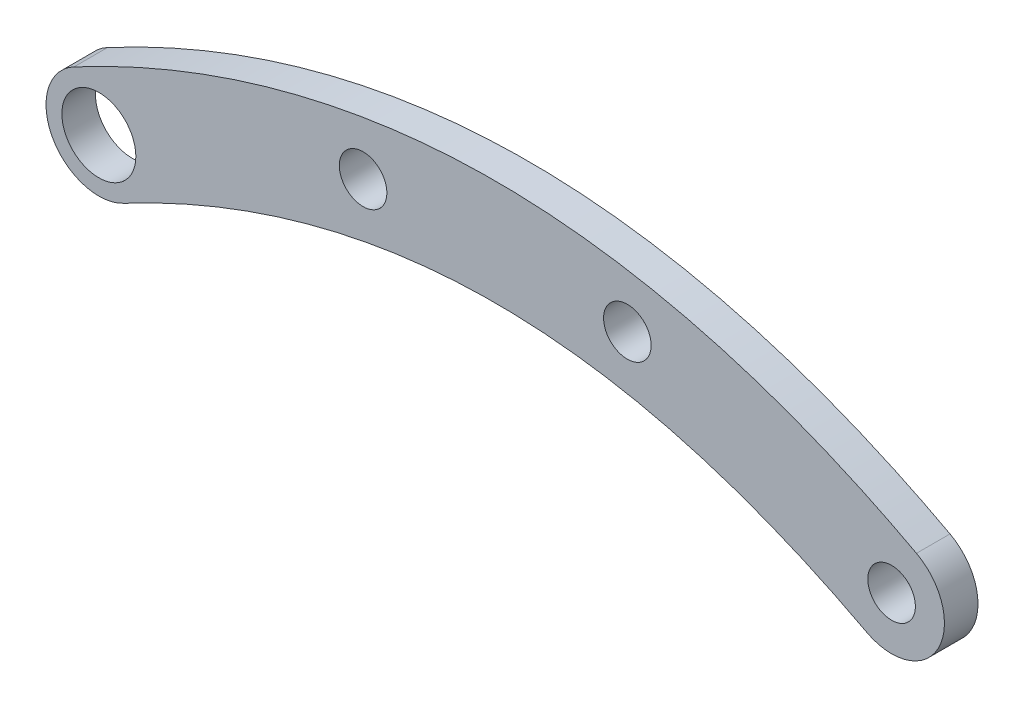
ISO-10303-21;
HEADER;
FILE_DESCRIPTION(('STEP AP214'),'2;1');
FILE_NAME('part.step','',(''),(''),'','','');
FILE_SCHEMA(('AUTOMOTIVE_DESIGN { 1 0 10303 214 1 1 1 1 }'));
ENDSEC;
DATA;
#1=APPLICATION_CONTEXT('core data for automotive mechanical design processes');
#2=APPLICATION_PROTOCOL_DEFINITION('international standard','automotive_design',2000,#1);
#3=PRODUCT_CONTEXT('',#1,'mechanical');
#4=PRODUCT('Part','Part','',(#3));
#5=PRODUCT_RELATED_PRODUCT_CATEGORY('part','',(#4));
#6=PRODUCT_DEFINITION_FORMATION('','',#4);
#7=PRODUCT_DEFINITION_CONTEXT('part definition',#1,'design');
#8=PRODUCT_DEFINITION('design','',#6,#7);
#9=PRODUCT_DEFINITION_SHAPE('','',#8);
#10=(LENGTH_UNIT() NAMED_UNIT(*) SI_UNIT(.MILLI.,.METRE.));
#11=(NAMED_UNIT(*) PLANE_ANGLE_UNIT() SI_UNIT($,.RADIAN.));
#12=(NAMED_UNIT(*) SI_UNIT($,.STERADIAN.) SOLID_ANGLE_UNIT());
#13=UNCERTAINTY_MEASURE_WITH_UNIT(LENGTH_MEASURE(1.E-05),#10,'distance_accuracy_value','');
#14=(GEOMETRIC_REPRESENTATION_CONTEXT(3) GLOBAL_UNCERTAINTY_ASSIGNED_CONTEXT((#13)) GLOBAL_UNIT_ASSIGNED_CONTEXT((#10,
#11,#12)) REPRESENTATION_CONTEXT('',''));
#15=CARTESIAN_POINT('',(0.,0.,0.));
#16=DIRECTION('',(0.,0.,1.));
#17=DIRECTION('',(1.,0.,0.));
#18=AXIS2_PLACEMENT_3D('',#15,#16,#17);
#19=CARTESIAN_POINT('',(-39.8529411764706,-5.58823529411765,1.5875));
#20=CARTESIAN_POINT('',(-25.0878353747758,2.31376151523475,1.5875));
#21=CARTESIAN_POINT('',(0.,5.67155962119131,1.5875));
#22=CARTESIAN_POINT('',(25.0878353747758,2.31376151523475,1.5875));
#23=CARTESIAN_POINT('',(39.8529411764706,-5.58823529411765,1.5875));
#24=B_SPLINE_CURVE_WITH_KNOTS('',2,(#19,#20,#21,#22,#23),.UNSPECIFIED.,.F.,.F.,(3,1,1,3),(0.,
0.375,0.625,1.),.UNSPECIFIED.);
#25=DIRECTION('',(0.,0.,-1.));
#26=VECTOR('',#25,1.);
#27=SURFACE_OF_LINEAR_EXTRUSION('',#24,#26);
#28=CARTESIAN_POINT('',(-39.8529411764706,-5.58823529411765,-1.5875));
#29=CARTESIAN_POINT('',(-25.0878353747758,2.31376151523475,-1.5875));
#30=CARTESIAN_POINT('',(0.,5.67155962119131,-1.5875));
#31=CARTESIAN_POINT('',(25.0878353747758,2.31376151523475,-1.5875));
#32=CARTESIAN_POINT('',(39.8529411764706,-5.58823529411765,-1.5875));
#33=B_SPLINE_CURVE_WITH_KNOTS('',2,(#28,#29,#30,#31,#32),.UNSPECIFIED.,.F.,.F.,(3,1,1,3),(0.,
0.375,0.625,1.),.UNSPECIFIED.);
#34=CARTESIAN_POINT('',(-39.8529411764706,-5.58823529411764,-1.5875));
#35=VERTEX_POINT('',#34);
#36=CARTESIAN_POINT('',(39.8529411764706,-5.58823529411765,-1.5875));
#37=VERTEX_POINT('',#36);
#38=EDGE_CURVE('E128',#35,#37,#33,.T.);
#39=ORIENTED_EDGE('',*,*,#38,.F.);
#40=DIRECTION('',(0.,0.,-1.));
#41=VECTOR('',#40,1.);
#42=CARTESIAN_POINT('',(-39.8529411764706,-5.58823529411764,1.5875));
#43=LINE('',#42,#41);
#44=CARTESIAN_POINT('',(-39.8529411764706,-5.58823529411764,1.5875));
#45=VERTEX_POINT('',#44);
#46=EDGE_CURVE('E11',#45,#35,#43,.T.);
#47=ORIENTED_EDGE('',*,*,#46,.F.);
#48=CARTESIAN_POINT('',(39.8529411764706,-5.58823529411765,1.5875));
#49=VERTEX_POINT('',#48);
#50=EDGE_CURVE('E101',#45,#49,#24,.T.);
#51=ORIENTED_EDGE('',*,*,#50,.T.);
#52=DIRECTION('',(0.,0.,-1.));
#53=VECTOR('',#52,1.);
#54=CARTESIAN_POINT('',(39.8529411764706,-5.58823529411765,1.5875));
#55=LINE('',#54,#53);
#56=EDGE_CURVE('E82',#49,#37,#55,.T.);
#57=ORIENTED_EDGE('',*,*,#56,.T.);
#58=EDGE_LOOP('',(#39,#47,#51,#57));
#59=FACE_BOUND('',#58,.T.);
#60=ADVANCED_FACE('F43',(#59),#27,.T.);
#61=CARTESIAN_POINT('',(-37.5,-10.,1.5875));
#62=DIRECTION('',(0.,0.,-1.));
#63=DIRECTION('',(-1.,0.,0.));
#64=AXIS2_PLACEMENT_3D('',#61,#62,#63);
#65=CYLINDRICAL_SURFACE('',#64,5.);
#66=CARTESIAN_POINT('',(-37.5,-10.,-1.5875));
#67=DIRECTION('',(0.,0.,1.));
#68=DIRECTION('',(1.,0.,0.));
#69=AXIS2_PLACEMENT_3D('',#66,#67,#68);
#70=CIRCLE('',#69,5.);
#71=CARTESIAN_POINT('',(-35.1470588235294,-14.4117647058824,-1.5875));
#72=VERTEX_POINT('',#71);
#73=EDGE_CURVE('E95',#72,#35,#70,.F.);
#74=ORIENTED_EDGE('',*,*,#73,.F.);
#75=DIRECTION('',(0.,0.,-1.));
#76=VECTOR('',#75,1.);
#77=CARTESIAN_POINT('',(-35.1470588235294,-14.4117647058824,1.5875));
#78=LINE('',#77,#76);
#79=CARTESIAN_POINT('',(-35.1470588235294,-14.4117647058824,1.5875));
#80=VERTEX_POINT('',#79);
#81=EDGE_CURVE('E52',#80,#72,#78,.T.);
#82=ORIENTED_EDGE('',*,*,#81,.F.);
#83=CARTESIAN_POINT('',(-37.5,-10.,1.5875));
#84=DIRECTION('',(0.,0.,1.));
#85=DIRECTION('',(1.,0.,0.));
#86=AXIS2_PLACEMENT_3D('',#83,#84,#85);
#87=CIRCLE('',#86,5.);
#88=EDGE_CURVE('E93',#80,#45,#87,.F.);
#89=ORIENTED_EDGE('',*,*,#88,.T.);
#90=ORIENTED_EDGE('',*,*,#46,.T.);
#91=EDGE_LOOP('',(#74,#82,#89,#90));
#92=FACE_BOUND('',#91,.T.);
#93=ADVANCED_FACE('F91',(#92),#65,.T.);
#94=CARTESIAN_POINT('',(-35.1470588235294,-14.4117647058824,1.5875));
#95=CARTESIAN_POINT('',(-21.7871646252242,-7.31376151523475,1.5875));
#96=CARTESIAN_POINT('',(0.,-4.42155962119131,1.5875));
#97=CARTESIAN_POINT('',(21.7871646252242,-7.31376151523475,1.5875));
#98=CARTESIAN_POINT('',(35.1470588235294,-14.4117647058824,1.5875));
#99=B_SPLINE_CURVE_WITH_KNOTS('',2,(#94,#95,#96,#97,#98),.UNSPECIFIED.,.F.,.F.,(3,1,1,3),(0.,
0.375,0.625,1.),.UNSPECIFIED.);
#100=DIRECTION('',(0.,0.,-1.));
#101=VECTOR('',#100,1.);
#102=SURFACE_OF_LINEAR_EXTRUSION('',#99,#101);
#103=CARTESIAN_POINT('',(-35.1470588235294,-14.4117647058824,-1.5875));
#104=CARTESIAN_POINT('',(-21.7871646252242,-7.31376151523475,-1.5875));
#105=CARTESIAN_POINT('',(0.,-4.42155962119131,-1.5875));
#106=CARTESIAN_POINT('',(21.7871646252242,-7.31376151523475,-1.5875));
#107=CARTESIAN_POINT('',(35.1470588235294,-14.4117647058824,-1.5875));
#108=B_SPLINE_CURVE_WITH_KNOTS('',2,(#103,#104,#105,#106,#107),.UNSPECIFIED.,.F.,.F.,(3,1,1,3),
(0.,0.375,0.625,1.),.UNSPECIFIED.);
#109=CARTESIAN_POINT('',(35.1470588235294,-14.4117647058824,-1.5875));
#110=VERTEX_POINT('',#109);
#111=EDGE_CURVE('E75',#72,#110,#108,.T.);
#112=ORIENTED_EDGE('',*,*,#111,.T.);
#113=DIRECTION('',(0.,0.,-1.));
#114=VECTOR('',#113,1.);
#115=CARTESIAN_POINT('',(35.1470588235294,-14.4117647058824,1.5875));
#116=LINE('',#115,#114);
#117=CARTESIAN_POINT('',(35.1470588235294,-14.4117647058824,1.5875));
#118=VERTEX_POINT('',#117);
#119=EDGE_CURVE('E96',#118,#110,#116,.T.);
#120=ORIENTED_EDGE('',*,*,#119,.F.);
#121=EDGE_CURVE('E97',#80,#118,#99,.T.);
#122=ORIENTED_EDGE('',*,*,#121,.F.);
#123=ORIENTED_EDGE('',*,*,#81,.T.);
#124=EDGE_LOOP('',(#112,#120,#122,#123));
#125=FACE_BOUND('',#124,.T.);
#126=ADVANCED_FACE('F98',(#125),#102,.F.);
#127=CARTESIAN_POINT('',(37.5,-10.,1.5875));
#128=DIRECTION('',(0.,0.,-1.));
#129=DIRECTION('',(-1.,0.,0.));
#130=AXIS2_PLACEMENT_3D('',#127,#128,#129);
#131=CYLINDRICAL_SURFACE('',#130,5.);
#132=CARTESIAN_POINT('',(37.5,-10.,-1.5875));
#133=DIRECTION('',(0.,0.,1.));
#134=DIRECTION('',(1.,0.,0.));
#135=AXIS2_PLACEMENT_3D('',#132,#133,#134);
#136=CIRCLE('',#135,5.);
#137=EDGE_CURVE('E103',#110,#37,#136,.T.);
#138=ORIENTED_EDGE('',*,*,#137,.T.);
#139=ORIENTED_EDGE('',*,*,#56,.F.);
#140=CARTESIAN_POINT('',(37.5,-10.,1.5875));
#141=DIRECTION('',(0.,0.,1.));
#142=DIRECTION('',(1.,0.,0.));
#143=AXIS2_PLACEMENT_3D('',#140,#141,#142);
#144=CIRCLE('',#143,5.);
#145=EDGE_CURVE('E60',#118,#49,#144,.T.);
#146=ORIENTED_EDGE('',*,*,#145,.F.);
#147=ORIENTED_EDGE('',*,*,#119,.T.);
#148=EDGE_LOOP('',(#138,#139,#146,#147));
#149=FACE_BOUND('',#148,.T.);
#150=ADVANCED_FACE('F119',(#149),#131,.T.);
#151=CARTESIAN_POINT('',(0.,0.,1.5875));
#152=DIRECTION('',(0.,0.,1.));
#153=DIRECTION('',(1.,0.,0.));
#154=AXIS2_PLACEMENT_3D('',#151,#152,#153);
#155=PLANE('',#154);
#156=CARTESIAN_POINT('',(-37.5,-10.,1.5875));
#157=DIRECTION('',(0.,0.,1.));
#158=DIRECTION('',(1.,0.,0.));
#159=AXIS2_PLACEMENT_3D('',#156,#157,#158);
#160=CIRCLE('',#159,3.5);
#161=CARTESIAN_POINT('',(-34.,-10.,1.5875));
#162=VERTEX_POINT('',#161);
#163=EDGE_CURVE('E181',#162,#162,#160,.T.);
#164=ORIENTED_EDGE('',*,*,#163,.F.);
#165=EDGE_LOOP('',(#164));
#166=FACE_BOUND('',#165,.T.);
#167=CARTESIAN_POINT('',(37.5,-10.,1.5875));
#168=DIRECTION('',(0.,0.,1.));
#169=DIRECTION('',(1.,0.,0.));
#170=AXIS2_PLACEMENT_3D('',#167,#168,#169);
#171=CIRCLE('',#170,2.24999999999999);
#172=CARTESIAN_POINT('',(39.75,-10.,1.5875));
#173=VERTEX_POINT('',#172);
#174=EDGE_CURVE('E183',#173,#173,#171,.T.);
#175=ORIENTED_EDGE('',*,*,#174,.F.);
#176=EDGE_LOOP('',(#175));
#177=FACE_BOUND('',#176,.T.);
#178=CARTESIAN_POINT('',(-12.5,-1.11111111111111,1.5875));
#179=DIRECTION('',(0.,0.,1.));
#180=DIRECTION('',(1.,0.,0.));
#181=AXIS2_PLACEMENT_3D('',#178,#179,#180);
#182=CIRCLE('',#181,2.24999999999999);
#183=CARTESIAN_POINT('',(-10.25,-1.11111111111111,1.5875));
#184=VERTEX_POINT('',#183);
#185=EDGE_CURVE('E191',#184,#184,#182,.T.);
#186=ORIENTED_EDGE('',*,*,#185,.F.);
#187=EDGE_LOOP('',(#186));
#188=FACE_BOUND('',#187,.T.);
#189=CARTESIAN_POINT('',(12.5,-1.11111111111111,1.5875));
#190=DIRECTION('',(0.,0.,1.));
#191=DIRECTION('',(1.,0.,0.));
#192=AXIS2_PLACEMENT_3D('',#189,#190,#191);
#193=CIRCLE('',#192,2.24999999999999);
#194=CARTESIAN_POINT('',(14.75,-1.11111111111111,1.5875));
#195=VERTEX_POINT('',#194);
#196=EDGE_CURVE('E197',#195,#195,#193,.T.);
#197=ORIENTED_EDGE('',*,*,#196,.F.);
#198=EDGE_LOOP('',(#197));
#199=FACE_BOUND('',#198,.T.);
#200=ORIENTED_EDGE('',*,*,#50,.F.);
#201=ORIENTED_EDGE('',*,*,#88,.F.);
#202=ORIENTED_EDGE('',*,*,#121,.T.);
#203=ORIENTED_EDGE('',*,*,#145,.T.);
#204=EDGE_LOOP('',(#200,#201,#202,#203));
#205=FACE_BOUND('',#204,.T.);
#206=ADVANCED_FACE('F100',(#166,#177,#188,#199,#205),#155,.T.);
#207=CARTESIAN_POINT('',(0.,0.,-1.5875));
#208=DIRECTION('',(0.,0.,1.));
#209=DIRECTION('',(1.,0.,0.));
#210=AXIS2_PLACEMENT_3D('',#207,#208,#209);
#211=PLANE('',#210);
#212=CARTESIAN_POINT('',(-37.5,-10.,-1.5875));
#213=DIRECTION('',(0.,0.,1.));
#214=DIRECTION('',(1.,0.,0.));
#215=AXIS2_PLACEMENT_3D('',#212,#213,#214);
#216=CIRCLE('',#215,3.5);
#217=CARTESIAN_POINT('',(-34.,-10.,-1.5875));
#218=VERTEX_POINT('',#217);
#219=EDGE_CURVE('E179',#218,#218,#216,.T.);
#220=ORIENTED_EDGE('',*,*,#219,.T.);
#221=EDGE_LOOP('',(#220));
#222=FACE_BOUND('',#221,.T.);
#223=CARTESIAN_POINT('',(37.5,-10.,-1.5875));
#224=DIRECTION('',(0.,0.,1.));
#225=DIRECTION('',(1.,0.,0.));
#226=AXIS2_PLACEMENT_3D('',#223,#224,#225);
#227=CIRCLE('',#226,2.25);
#228=CARTESIAN_POINT('',(39.75,-10.,-1.5875));
#229=VERTEX_POINT('',#228);
#230=EDGE_CURVE('E188',#229,#229,#227,.T.);
#231=ORIENTED_EDGE('',*,*,#230,.T.);
#232=EDGE_LOOP('',(#231));
#233=FACE_BOUND('',#232,.T.);
#234=CARTESIAN_POINT('',(-12.5,-1.11111111111111,-1.5875));
#235=DIRECTION('',(0.,0.,1.));
#236=DIRECTION('',(1.,0.,0.));
#237=AXIS2_PLACEMENT_3D('',#234,#235,#236);
#238=CIRCLE('',#237,2.25);
#239=CARTESIAN_POINT('',(-10.25,-1.11111111111111,-1.5875));
#240=VERTEX_POINT('',#239);
#241=EDGE_CURVE('E194',#240,#240,#238,.T.);
#242=ORIENTED_EDGE('',*,*,#241,.T.);
#243=EDGE_LOOP('',(#242));
#244=FACE_BOUND('',#243,.T.);
#245=CARTESIAN_POINT('',(12.5,-1.11111111111111,-1.5875));
#246=DIRECTION('',(0.,0.,1.));
#247=DIRECTION('',(1.,0.,0.));
#248=AXIS2_PLACEMENT_3D('',#245,#246,#247);
#249=CIRCLE('',#248,2.25);
#250=CARTESIAN_POINT('',(14.75,-1.11111111111111,-1.5875));
#251=VERTEX_POINT('',#250);
#252=EDGE_CURVE('E131',#251,#251,#249,.T.);
#253=ORIENTED_EDGE('',*,*,#252,.T.);
#254=EDGE_LOOP('',(#253));
#255=FACE_BOUND('',#254,.T.);
#256=ORIENTED_EDGE('',*,*,#38,.T.);
#257=ORIENTED_EDGE('',*,*,#137,.F.);
#258=ORIENTED_EDGE('',*,*,#111,.F.);
#259=ORIENTED_EDGE('',*,*,#73,.T.);
#260=EDGE_LOOP('',(#256,#257,#258,#259));
#261=FACE_BOUND('',#260,.T.);
#262=ADVANCED_FACE('F132',(#222,#233,#244,#255,#261),#211,.F.);
#263=CARTESIAN_POINT('',(12.5,-1.11111111111111,1.5875));
#264=DIRECTION('',(0.,0.,1.));
#265=DIRECTION('',(1.,0.,0.));
#266=AXIS2_PLACEMENT_3D('',#263,#264,#265);
#267=CYLINDRICAL_SURFACE('',#266,2.24999999999999);
#268=ORIENTED_EDGE('',*,*,#252,.F.);
#269=EDGE_LOOP('',(#268));
#270=FACE_BOUND('',#269,.T.);
#271=ORIENTED_EDGE('',*,*,#196,.T.);
#272=EDGE_LOOP('',(#271));
#273=FACE_BOUND('',#272,.T.);
#274=ADVANCED_FACE('F156',(#270,#273),#267,.F.);
#275=CARTESIAN_POINT('',(-12.5,-1.11111111111111,1.5875));
#276=DIRECTION('',(0.,0.,1.));
#277=DIRECTION('',(1.,0.,0.));
#278=AXIS2_PLACEMENT_3D('',#275,#276,#277);
#279=CYLINDRICAL_SURFACE('',#278,2.24999999999999);
#280=ORIENTED_EDGE('',*,*,#241,.F.);
#281=EDGE_LOOP('',(#280));
#282=FACE_BOUND('',#281,.T.);
#283=ORIENTED_EDGE('',*,*,#185,.T.);
#284=EDGE_LOOP('',(#283));
#285=FACE_BOUND('',#284,.T.);
#286=ADVANCED_FACE('F163',(#282,#285),#279,.F.);
#287=CARTESIAN_POINT('',(37.5,-10.,1.5875));
#288=DIRECTION('',(0.,0.,1.));
#289=DIRECTION('',(1.,0.,0.));
#290=AXIS2_PLACEMENT_3D('',#287,#288,#289);
#291=CYLINDRICAL_SURFACE('',#290,2.25);
#292=ORIENTED_EDGE('',*,*,#230,.F.);
#293=EDGE_LOOP('',(#292));
#294=FACE_BOUND('',#293,.T.);
#295=ORIENTED_EDGE('',*,*,#174,.T.);
#296=EDGE_LOOP('',(#295));
#297=FACE_BOUND('',#296,.T.);
#298=ADVANCED_FACE('F167',(#294,#297),#291,.F.);
#299=CARTESIAN_POINT('',(-37.5,-10.,-1.5875));
#300=DIRECTION('',(0.,0.,1.));
#301=DIRECTION('',(1.,0.,0.));
#302=AXIS2_PLACEMENT_3D('',#299,#300,#301);
#303=CYLINDRICAL_SURFACE('',#302,3.5);
#304=ORIENTED_EDGE('',*,*,#219,.F.);
#305=EDGE_LOOP('',(#304));
#306=FACE_BOUND('',#305,.T.);
#307=ORIENTED_EDGE('',*,*,#163,.T.);
#308=EDGE_LOOP('',(#307));
#309=FACE_BOUND('',#308,.T.);
#310=ADVANCED_FACE('F170',(#306,#309),#303,.F.);
#311=CLOSED_SHELL('',(#60,#93,#126,#150,#206,#262,#274,#286,#298,#310));
#312=MANIFOLD_SOLID_BREP('B2',#311);
#313=ADVANCED_BREP_SHAPE_REPRESENTATION('',(#18,#312),#14);
#314=SHAPE_DEFINITION_REPRESENTATION(#9,#313);
ENDSEC;
END-ISO-10303-21;
